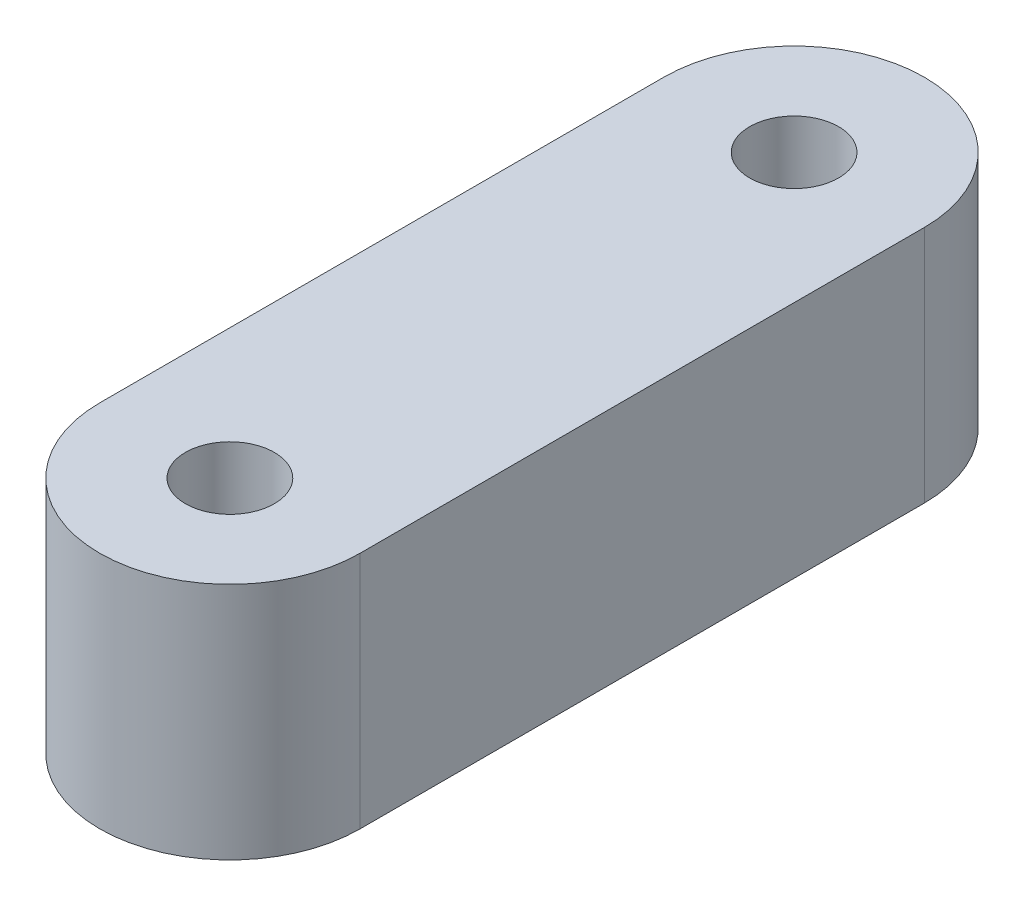
ISO-10303-21;
HEADER;
FILE_DESCRIPTION(('STEP AP214'),'2;1');
FILE_NAME('part.step','',(''),(''),'','','');
FILE_SCHEMA(('AUTOMOTIVE_DESIGN { 1 0 10303 214 1 1 1 1 }'));
ENDSEC;
DATA;
#1=APPLICATION_CONTEXT('core data for automotive mechanical design processes');
#2=APPLICATION_PROTOCOL_DEFINITION('international standard','automotive_design',2000,#1);
#3=PRODUCT_CONTEXT('',#1,'mechanical');
#4=PRODUCT('Part','Part','',(#3));
#5=PRODUCT_RELATED_PRODUCT_CATEGORY('part','',(#4));
#6=PRODUCT_DEFINITION_FORMATION('','',#4);
#7=PRODUCT_DEFINITION_CONTEXT('part definition',#1,'design');
#8=PRODUCT_DEFINITION('design','',#6,#7);
#9=PRODUCT_DEFINITION_SHAPE('','',#8);
#10=(LENGTH_UNIT() NAMED_UNIT(*) SI_UNIT(.MILLI.,.METRE.));
#11=(NAMED_UNIT(*) PLANE_ANGLE_UNIT() SI_UNIT($,.RADIAN.));
#12=(NAMED_UNIT(*) SI_UNIT($,.STERADIAN.) SOLID_ANGLE_UNIT());
#13=UNCERTAINTY_MEASURE_WITH_UNIT(LENGTH_MEASURE(1.E-05),#10,'distance_accuracy_value','');
#14=(GEOMETRIC_REPRESENTATION_CONTEXT(3) GLOBAL_UNCERTAINTY_ASSIGNED_CONTEXT((#13)) GLOBAL_UNIT_ASSIGNED_CONTEXT((#10,
#11,#12)) REPRESENTATION_CONTEXT('',''));
#15=CARTESIAN_POINT('',(0.,0.,0.));
#16=DIRECTION('',(0.,0.,1.));
#17=DIRECTION('',(1.,0.,0.));
#18=AXIS2_PLACEMENT_3D('',#15,#16,#17);
#19=CARTESIAN_POINT('',(4.,5.5,0.));
#20=DIRECTION('',(-1.,0.,0.));
#21=DIRECTION('',(0.,0.,1.));
#22=AXIS2_PLACEMENT_3D('',#19,#20,#21);
#23=CYLINDRICAL_SURFACE('',#22,3.1);
#24=DIRECTION('',(-1.,0.,0.));
#25=VECTOR('',#24,1.);
#26=CARTESIAN_POINT('',(4.,3.75,2.5588083163848));
#27=LINE('',#26,#25);
#28=CARTESIAN_POINT('',(4.,3.75,2.5588083163848));
#29=VERTEX_POINT('',#28);
#30=CARTESIAN_POINT('',(-6.,3.75,2.5588083163848));
#31=VERTEX_POINT('',#30);
#32=EDGE_CURVE('E56',#29,#31,#27,.T.);
#33=ORIENTED_EDGE('',*,*,#32,.T.);
#34=CARTESIAN_POINT('',(-6.,5.5,0.));
#35=DIRECTION('',(-1.,0.,0.));
#36=DIRECTION('',(0.,0.,1.));
#37=AXIS2_PLACEMENT_3D('',#34,#35,#36);
#38=CIRCLE('',#37,3.1);
#39=CARTESIAN_POINT('',(-6.,3.75,-2.5588083163848));
#40=VERTEX_POINT('',#39);
#41=EDGE_CURVE('E114',#31,#40,#38,.T.);
#42=ORIENTED_EDGE('',*,*,#41,.T.);
#43=DIRECTION('',(-1.,0.,0.));
#44=VECTOR('',#43,1.);
#45=CARTESIAN_POINT('',(4.,3.75,-2.5588083163848));
#46=LINE('',#45,#44);
#47=CARTESIAN_POINT('',(4.,3.75,-2.5588083163848));
#48=VERTEX_POINT('',#47);
#49=EDGE_CURVE('E103',#48,#40,#46,.T.);
#50=ORIENTED_EDGE('',*,*,#49,.F.);
#51=CARTESIAN_POINT('',(4.,5.5,0.));
#52=DIRECTION('',(-1.,0.,0.));
#53=DIRECTION('',(0.,0.,1.));
#54=AXIS2_PLACEMENT_3D('',#51,#52,#53);
#55=CIRCLE('',#54,3.1);
#56=EDGE_CURVE('E112',#29,#48,#55,.T.);
#57=ORIENTED_EDGE('',*,*,#56,.F.);
#58=EDGE_LOOP('',(#33,#42,#50,#57));
#59=FACE_BOUND('',#58,.T.);
#60=ADVANCED_FACE('F41',(#59),#23,.F.);
#61=CARTESIAN_POINT('',(4.,5.5,0.));
#62=DIRECTION('',(-1.,0.,0.));
#63=DIRECTION('',(0.,0.,1.));
#64=AXIS2_PLACEMENT_3D('',#61,#62,#63);
#65=PLANE('',#64);
#66=ORIENTED_EDGE('',*,*,#56,.T.);
#67=DIRECTION('',(0.,0.,1.));
#68=VECTOR('',#67,1.);
#69=CARTESIAN_POINT('',(4.,3.75,0.));
#70=LINE('',#69,#68);
#71=EDGE_CURVE('E100',#48,#29,#70,.T.);
#72=ORIENTED_EDGE('',*,*,#71,.T.);
#73=EDGE_LOOP('',(#66,#72));
#74=FACE_BOUND('',#73,.T.);
#75=ADVANCED_FACE('F116',(#74),#65,.T.);
#76=CARTESIAN_POINT('',(0.,11.,13.));
#77=DIRECTION('',(0.,-1.,0.));
#78=DIRECTION('',(0.,0.,-1.));
#79=AXIS2_PLACEMENT_3D('',#76,#77,#78);
#80=CYLINDRICAL_SURFACE('',#79,6.);
#81=CARTESIAN_POINT('',(0.,0.,13.));
#82=DIRECTION('',(0.,1.,0.));
#83=DIRECTION('',(0.,0.,1.));
#84=AXIS2_PLACEMENT_3D('',#81,#82,#83);
#85=CIRCLE('',#84,6.);
#86=CARTESIAN_POINT('',(-6.,0.,13.));
#87=VERTEX_POINT('',#86);
#88=CARTESIAN_POINT('',(6.,0.,13.));
#89=VERTEX_POINT('',#88);
#90=EDGE_CURVE('E128',#87,#89,#85,.T.);
#91=ORIENTED_EDGE('',*,*,#90,.T.);
#92=DIRECTION('',(0.,-1.,0.));
#93=VECTOR('',#92,1.);
#94=CARTESIAN_POINT('',(6.,11.,13.));
#95=LINE('',#94,#93);
#96=CARTESIAN_POINT('',(6.,11.,13.));
#97=VERTEX_POINT('',#96);
#98=EDGE_CURVE('E11',#97,#89,#95,.T.);
#99=ORIENTED_EDGE('',*,*,#98,.F.);
#100=CARTESIAN_POINT('',(0.,11.,13.));
#101=DIRECTION('',(0.,1.,0.));
#102=DIRECTION('',(0.,0.,1.));
#103=AXIS2_PLACEMENT_3D('',#100,#101,#102);
#104=CIRCLE('',#103,6.);
#105=CARTESIAN_POINT('',(-6.,11.,13.));
#106=VERTEX_POINT('',#105);
#107=EDGE_CURVE('E134',#106,#97,#104,.T.);
#108=ORIENTED_EDGE('',*,*,#107,.F.);
#109=DIRECTION('',(0.,-1.,0.));
#110=VECTOR('',#109,1.);
#111=CARTESIAN_POINT('',(-6.,11.,13.));
#112=LINE('',#111,#110);
#113=EDGE_CURVE('E140',#106,#87,#112,.T.);
#114=ORIENTED_EDGE('',*,*,#113,.T.);
#115=EDGE_LOOP('',(#91,#99,#108,#114));
#116=FACE_BOUND('',#115,.T.);
#117=ADVANCED_FACE('F43',(#116),#80,.T.);
#118=CARTESIAN_POINT('',(6.,11.,13.));
#119=DIRECTION('',(-1.,0.,0.));
#120=DIRECTION('',(0.,0.,1.));
#121=AXIS2_PLACEMENT_3D('',#118,#119,#120);
#122=PLANE('',#121);
#123=DIRECTION('',(0.,0.,-1.));
#124=VECTOR('',#123,1.);
#125=CARTESIAN_POINT('',(6.,0.,13.));
#126=LINE('',#125,#124);
#127=CARTESIAN_POINT('',(6.,0.,-13.));
#128=VERTEX_POINT('',#127);
#129=EDGE_CURVE('E143',#89,#128,#126,.T.);
#130=ORIENTED_EDGE('',*,*,#129,.T.);
#131=DIRECTION('',(0.,-1.,0.));
#132=VECTOR('',#131,1.);
#133=CARTESIAN_POINT('',(6.,11.,-13.));
#134=LINE('',#133,#132);
#135=CARTESIAN_POINT('',(6.,11.,-13.));
#136=VERTEX_POINT('',#135);
#137=EDGE_CURVE('E49',#136,#128,#134,.T.);
#138=ORIENTED_EDGE('',*,*,#137,.F.);
#139=DIRECTION('',(0.,0.,-1.));
#140=VECTOR('',#139,1.);
#141=CARTESIAN_POINT('',(6.,11.,13.));
#142=LINE('',#141,#140);
#143=EDGE_CURVE('E93',#97,#136,#142,.T.);
#144=ORIENTED_EDGE('',*,*,#143,.F.);
#145=ORIENTED_EDGE('',*,*,#98,.T.);
#146=EDGE_LOOP('',(#130,#138,#144,#145));
#147=FACE_BOUND('',#146,.T.);
#148=ADVANCED_FACE('F175',(#147),#122,.F.);
#149=CARTESIAN_POINT('',(0.,11.,-13.));
#150=DIRECTION('',(0.,-1.,0.));
#151=DIRECTION('',(0.,0.,-1.));
#152=AXIS2_PLACEMENT_3D('',#149,#150,#151);
#153=CYLINDRICAL_SURFACE('',#152,6.);
#154=CARTESIAN_POINT('',(0.,0.,-13.));
#155=DIRECTION('',(0.,1.,0.));
#156=DIRECTION('',(0.,0.,1.));
#157=AXIS2_PLACEMENT_3D('',#154,#155,#156);
#158=CIRCLE('',#157,6.);
#159=CARTESIAN_POINT('',(-6.00000000000001,0.,-13.));
#160=VERTEX_POINT('',#159);
#161=EDGE_CURVE('E145',#128,#160,#158,.T.);
#162=ORIENTED_EDGE('',*,*,#161,.T.);
#163=DIRECTION('',(0.,-1.,0.));
#164=VECTOR('',#163,1.);
#165=CARTESIAN_POINT('',(-6.00000000000001,11.,-13.));
#166=LINE('',#165,#164);
#167=CARTESIAN_POINT('',(-6.00000000000001,11.,-13.));
#168=VERTEX_POINT('',#167);
#169=EDGE_CURVE('E149',#168,#160,#166,.T.);
#170=ORIENTED_EDGE('',*,*,#169,.F.);
#171=CARTESIAN_POINT('',(0.,11.,-13.));
#172=DIRECTION('',(0.,1.,0.));
#173=DIRECTION('',(0.,0.,1.));
#174=AXIS2_PLACEMENT_3D('',#171,#172,#173);
#175=CIRCLE('',#174,6.);
#176=EDGE_CURVE('E137',#136,#168,#175,.T.);
#177=ORIENTED_EDGE('',*,*,#176,.F.);
#178=ORIENTED_EDGE('',*,*,#137,.T.);
#179=EDGE_LOOP('',(#162,#170,#177,#178));
#180=FACE_BOUND('',#179,.T.);
#181=ADVANCED_FACE('F154',(#180),#153,.T.);
#182=CARTESIAN_POINT('',(-6.,11.,13.));
#183=DIRECTION('',(1.,0.,0.));
#184=DIRECTION('',(0.,0.,-1.));
#185=AXIS2_PLACEMENT_3D('',#182,#183,#184);
#186=PLANE('',#185);
#187=ORIENTED_EDGE('',*,*,#41,.F.);
#188=DIRECTION('',(0.,0.,1.));
#189=VECTOR('',#188,1.);
#190=CARTESIAN_POINT('',(-6.,3.75,0.));
#191=LINE('',#190,#189);
#192=EDGE_CURVE('E108',#40,#31,#191,.T.);
#193=ORIENTED_EDGE('',*,*,#192,.F.);
#194=EDGE_LOOP('',(#187,#193));
#195=FACE_BOUND('',#194,.T.);
#196=DIRECTION('',(0.,0.,1.));
#197=VECTOR('',#196,1.);
#198=CARTESIAN_POINT('',(-6.,0.,13.));
#199=LINE('',#198,#197);
#200=EDGE_CURVE('E86',#160,#87,#199,.T.);
#201=ORIENTED_EDGE('',*,*,#200,.T.);
#202=ORIENTED_EDGE('',*,*,#113,.F.);
#203=DIRECTION('',(0.,0.,1.));
#204=VECTOR('',#203,1.);
#205=CARTESIAN_POINT('',(-6.,11.,13.));
#206=LINE('',#205,#204);
#207=EDGE_CURVE('E65',#168,#106,#206,.T.);
#208=ORIENTED_EDGE('',*,*,#207,.F.);
#209=ORIENTED_EDGE('',*,*,#169,.T.);
#210=EDGE_LOOP('',(#201,#202,#208,#209));
#211=FACE_BOUND('',#210,.T.);
#212=ADVANCED_FACE('F162',(#195,#211),#186,.F.);
#213=CARTESIAN_POINT('',(0.,11.,13.));
#214=DIRECTION('',(0.,1.,0.));
#215=DIRECTION('',(0.,0.,1.));
#216=AXIS2_PLACEMENT_3D('',#213,#214,#215);
#217=PLANE('',#216);
#218=CARTESIAN_POINT('',(0.,11.,-13.));
#219=DIRECTION('',(0.,1.,0.));
#220=DIRECTION('',(0.,0.,1.));
#221=AXIS2_PLACEMENT_3D('',#218,#219,#220);
#222=CIRCLE('',#221,2.05);
#223=CARTESIAN_POINT('',(0.,11.,-10.95));
#224=VERTEX_POINT('',#223);
#225=EDGE_CURVE('E129',#224,#224,#222,.T.);
#226=ORIENTED_EDGE('',*,*,#225,.F.);
#227=EDGE_LOOP('',(#226));
#228=FACE_BOUND('',#227,.T.);
#229=CARTESIAN_POINT('',(0.,11.,13.));
#230=DIRECTION('',(0.,1.,0.));
#231=DIRECTION('',(0.,0.,1.));
#232=AXIS2_PLACEMENT_3D('',#229,#230,#231);
#233=CIRCLE('',#232,2.05);
#234=CARTESIAN_POINT('',(0.,11.,15.05));
#235=VERTEX_POINT('',#234);
#236=EDGE_CURVE('E117',#235,#235,#233,.T.);
#237=ORIENTED_EDGE('',*,*,#236,.F.);
#238=EDGE_LOOP('',(#237));
#239=FACE_BOUND('',#238,.T.);
#240=ORIENTED_EDGE('',*,*,#107,.T.);
#241=ORIENTED_EDGE('',*,*,#143,.T.);
#242=ORIENTED_EDGE('',*,*,#176,.T.);
#243=ORIENTED_EDGE('',*,*,#207,.T.);
#244=EDGE_LOOP('',(#240,#241,#242,#243));
#245=FACE_BOUND('',#244,.T.);
#246=ADVANCED_FACE('F164',(#228,#239,#245),#217,.T.);
#247=CARTESIAN_POINT('',(0.,0.,13.));
#248=DIRECTION('',(0.,1.,0.));
#249=DIRECTION('',(0.,0.,1.));
#250=AXIS2_PLACEMENT_3D('',#247,#248,#249);
#251=PLANE('',#250);
#252=CARTESIAN_POINT('',(0.,0.,-13.));
#253=DIRECTION('',(0.,1.,0.));
#254=DIRECTION('',(0.,0.,1.));
#255=AXIS2_PLACEMENT_3D('',#252,#253,#254);
#256=CIRCLE('',#255,2.05);
#257=CARTESIAN_POINT('',(0.,0.,-10.95));
#258=VERTEX_POINT('',#257);
#259=EDGE_CURVE('E125',#258,#258,#256,.T.);
#260=ORIENTED_EDGE('',*,*,#259,.T.);
#261=EDGE_LOOP('',(#260));
#262=FACE_BOUND('',#261,.T.);
#263=CARTESIAN_POINT('',(0.,0.,13.));
#264=DIRECTION('',(0.,1.,0.));
#265=DIRECTION('',(0.,0.,1.));
#266=AXIS2_PLACEMENT_3D('',#263,#264,#265);
#267=CIRCLE('',#266,2.05);
#268=CARTESIAN_POINT('',(0.,0.,15.05));
#269=VERTEX_POINT('',#268);
#270=EDGE_CURVE('E120',#269,#269,#267,.T.);
#271=ORIENTED_EDGE('',*,*,#270,.T.);
#272=EDGE_LOOP('',(#271));
#273=FACE_BOUND('',#272,.T.);
#274=ORIENTED_EDGE('',*,*,#90,.F.);
#275=ORIENTED_EDGE('',*,*,#200,.F.);
#276=ORIENTED_EDGE('',*,*,#161,.F.);
#277=ORIENTED_EDGE('',*,*,#129,.F.);
#278=EDGE_LOOP('',(#274,#275,#276,#277));
#279=FACE_BOUND('',#278,.T.);
#280=ADVANCED_FACE('F158',(#262,#273,#279),#251,.F.);
#281=CARTESIAN_POINT('',(0.,0.,13.));
#282=DIRECTION('',(0.,1.,0.));
#283=DIRECTION('',(0.,0.,1.));
#284=AXIS2_PLACEMENT_3D('',#281,#282,#283);
#285=CYLINDRICAL_SURFACE('',#284,2.05);
#286=ORIENTED_EDGE('',*,*,#270,.F.);
#287=EDGE_LOOP('',(#286));
#288=FACE_BOUND('',#287,.T.);
#289=ORIENTED_EDGE('',*,*,#236,.T.);
#290=EDGE_LOOP('',(#289));
#291=FACE_BOUND('',#290,.T.);
#292=ADVANCED_FACE('F189',(#288,#291),#285,.F.);
#293=CARTESIAN_POINT('',(0.,0.,-13.));
#294=DIRECTION('',(0.,1.,0.));
#295=DIRECTION('',(0.,0.,1.));
#296=AXIS2_PLACEMENT_3D('',#293,#294,#295);
#297=CYLINDRICAL_SURFACE('',#296,2.05);
#298=ORIENTED_EDGE('',*,*,#259,.F.);
#299=EDGE_LOOP('',(#298));
#300=FACE_BOUND('',#299,.T.);
#301=ORIENTED_EDGE('',*,*,#225,.T.);
#302=EDGE_LOOP('',(#301));
#303=FACE_BOUND('',#302,.T.);
#304=ADVANCED_FACE('F186',(#300,#303),#297,.F.);
#305=CARTESIAN_POINT('',(4.,3.75,0.));
#306=DIRECTION('',(0.,-1.,0.));
#307=DIRECTION('',(0.,0.,-1.));
#308=AXIS2_PLACEMENT_3D('',#305,#306,#307);
#309=PLANE('',#308);
#310=ORIENTED_EDGE('',*,*,#192,.T.);
#311=ORIENTED_EDGE('',*,*,#32,.F.);
#312=ORIENTED_EDGE('',*,*,#71,.F.);
#313=ORIENTED_EDGE('',*,*,#49,.T.);
#314=EDGE_LOOP('',(#310,#311,#312,#313));
#315=FACE_BOUND('',#314,.T.);
#316=ADVANCED_FACE('F102',(#315),#309,.F.);
#317=CLOSED_SHELL('',(#60,#75,#117,#148,#181,#212,#246,#280,#292,#304,#316));
#318=MANIFOLD_SOLID_BREP('B2',#317);
#319=ADVANCED_BREP_SHAPE_REPRESENTATION('',(#18,#318),#14);
#320=SHAPE_DEFINITION_REPRESENTATION(#9,#319);
ENDSEC;
END-ISO-10303-21;
